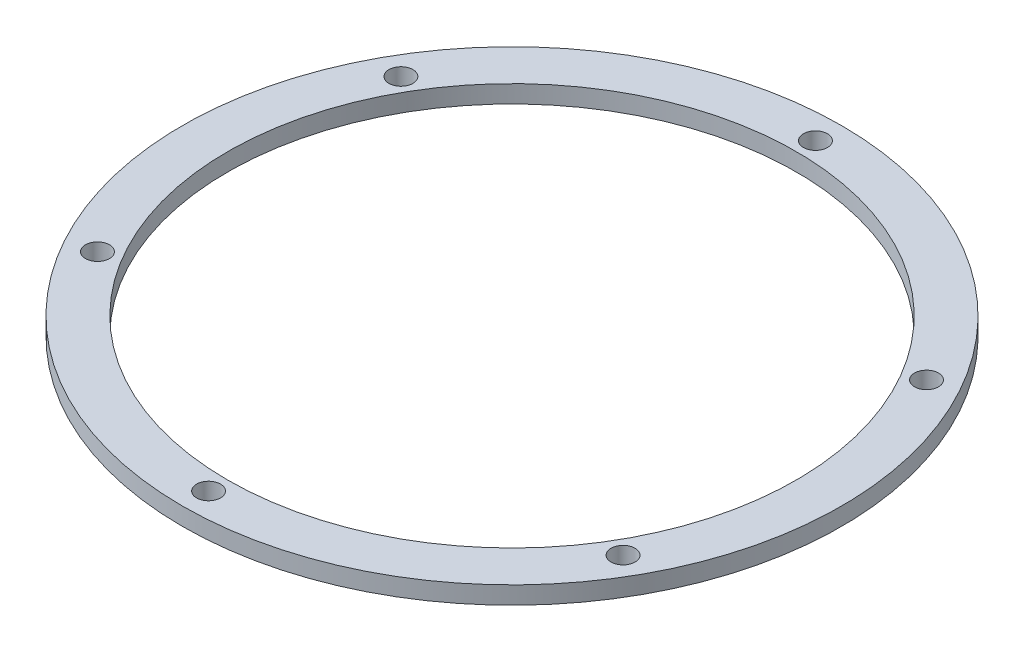
ISO-10303-21;
HEADER;
FILE_DESCRIPTION(('STEP AP214'),'2;1');
FILE_NAME('part.step','',(''),(''),'','','');
FILE_SCHEMA(('AUTOMOTIVE_DESIGN { 1 0 10303 214 1 1 1 1 }'));
ENDSEC;
DATA;
#1=APPLICATION_CONTEXT('core data for automotive mechanical design processes');
#2=APPLICATION_PROTOCOL_DEFINITION('international standard','automotive_design',2000,#1);
#3=PRODUCT_CONTEXT('',#1,'mechanical');
#4=PRODUCT('Part','Part','',(#3));
#5=PRODUCT_RELATED_PRODUCT_CATEGORY('part','',(#4));
#6=PRODUCT_DEFINITION_FORMATION('','',#4);
#7=PRODUCT_DEFINITION_CONTEXT('part definition',#1,'design');
#8=PRODUCT_DEFINITION('design','',#6,#7);
#9=PRODUCT_DEFINITION_SHAPE('','',#8);
#10=(LENGTH_UNIT() NAMED_UNIT(*) SI_UNIT(.MILLI.,.METRE.));
#11=(NAMED_UNIT(*) PLANE_ANGLE_UNIT() SI_UNIT($,.RADIAN.));
#12=(NAMED_UNIT(*) SI_UNIT($,.STERADIAN.) SOLID_ANGLE_UNIT());
#13=UNCERTAINTY_MEASURE_WITH_UNIT(LENGTH_MEASURE(1.E-05),#10,'distance_accuracy_value','');
#14=(GEOMETRIC_REPRESENTATION_CONTEXT(3) GLOBAL_UNCERTAINTY_ASSIGNED_CONTEXT((#13)) GLOBAL_UNIT_ASSIGNED_CONTEXT((#10,
#11,#12)) REPRESENTATION_CONTEXT('',''));
#15=CARTESIAN_POINT('',(0.,0.,0.));
#16=DIRECTION('',(0.,0.,1.));
#17=DIRECTION('',(1.,0.,0.));
#18=AXIS2_PLACEMENT_3D('',#15,#16,#17);
#19=CARTESIAN_POINT('',(0.,3.175,0.));
#20=DIRECTION('',(0.,1.,0.));
#21=DIRECTION('',(0.,0.,1.));
#22=AXIS2_PLACEMENT_3D('',#19,#20,#21);
#23=PLANE('',#22);
#24=CARTESIAN_POINT('',(47.2936473006679,3.175,-27.3050000000006));
#25=DIRECTION('',(0.,1.,0.));
#26=DIRECTION('',(-0.866025403784433,0.,0.50000000000001));
#27=AXIS2_PLACEMENT_3D('',#24,#25,#26);
#28=CIRCLE('',#27,2.159);
#29=CARTESIAN_POINT('',(45.4238984538973,3.175,-26.2255000000005));
#30=VERTEX_POINT('',#29);
#31=EDGE_CURVE('E67',#30,#30,#28,.T.);
#32=ORIENTED_EDGE('',*,*,#31,.F.);
#33=EDGE_LOOP('',(#32));
#34=FACE_BOUND('',#33,.T.);
#35=CARTESIAN_POINT('',(47.2936473006684,3.175,27.3049999999996));
#36=DIRECTION('',(0.,1.,0.));
#37=DIRECTION('',(-0.866025403784443,0.,-0.499999999999992));
#38=AXIS2_PLACEMENT_3D('',#35,#36,#37);
#39=CIRCLE('',#38,2.159);
#40=CARTESIAN_POINT('',(45.4238984538978,3.175,26.2254999999996));
#41=VERTEX_POINT('',#40);
#42=EDGE_CURVE('E66',#41,#41,#39,.T.);
#43=ORIENTED_EDGE('',*,*,#42,.F.);
#44=EDGE_LOOP('',(#43));
#45=FACE_BOUND('',#44,.T.);
#46=CARTESIAN_POINT('',(0.,3.175,54.61));
#47=DIRECTION('',(0.,1.,0.));
#48=DIRECTION('',(0.,0.,-1.));
#49=AXIS2_PLACEMENT_3D('',#46,#47,#48);
#50=CIRCLE('',#49,2.159);
#51=CARTESIAN_POINT('',(0.,3.175,52.451));
#52=VERTEX_POINT('',#51);
#53=EDGE_CURVE('E73',#52,#52,#50,.T.);
#54=ORIENTED_EDGE('',*,*,#53,.F.);
#55=EDGE_LOOP('',(#54));
#56=FACE_BOUND('',#55,.T.);
#57=CARTESIAN_POINT('',(-47.2936473006681,3.175,27.3050000000002));
#58=DIRECTION('',(0.,1.,0.));
#59=DIRECTION('',(0.866025403784436,0.,-0.500000000000004));
#60=AXIS2_PLACEMENT_3D('',#57,#58,#59);
#61=CIRCLE('',#60,2.159);
#62=CARTESIAN_POINT('',(-45.4238984538975,3.175,26.2255000000002));
#63=VERTEX_POINT('',#62);
#64=EDGE_CURVE('E79',#63,#63,#61,.T.);
#65=ORIENTED_EDGE('',*,*,#64,.F.);
#66=EDGE_LOOP('',(#65));
#67=FACE_BOUND('',#66,.T.);
#68=CARTESIAN_POINT('',(-47.2936473006683,3.175,-27.3049999999999));
#69=DIRECTION('',(0.,1.,0.));
#70=DIRECTION('',(0.86602540378444,0.,0.499999999999998));
#71=AXIS2_PLACEMENT_3D('',#68,#69,#70);
#72=CIRCLE('',#71,2.159);
#73=CARTESIAN_POINT('',(-45.4238984538976,3.175,-26.2254999999999));
#74=VERTEX_POINT('',#73);
#75=EDGE_CURVE('E59',#74,#74,#72,.T.);
#76=ORIENTED_EDGE('',*,*,#75,.F.);
#77=EDGE_LOOP('',(#76));
#78=FACE_BOUND('',#77,.T.);
#79=CARTESIAN_POINT('',(0.,3.175,-54.61));
#80=DIRECTION('',(0.,1.,0.));
#81=DIRECTION('',(0.,0.,1.));
#82=AXIS2_PLACEMENT_3D('',#79,#80,#81);
#83=CIRCLE('',#82,2.159);
#84=CARTESIAN_POINT('',(0.,3.175,-52.451));
#85=VERTEX_POINT('',#84);
#86=EDGE_CURVE('E53',#85,#85,#83,.T.);
#87=ORIENTED_EDGE('',*,*,#86,.F.);
#88=EDGE_LOOP('',(#87));
#89=FACE_BOUND('',#88,.T.);
#90=CARTESIAN_POINT('',(0.,3.175,0.));
#91=DIRECTION('',(0.,1.,0.));
#92=DIRECTION('',(0.,0.,1.));
#93=AXIS2_PLACEMENT_3D('',#90,#91,#92);
#94=CIRCLE('',#93,59.309);
#95=CARTESIAN_POINT('',(0.,3.175,59.309));
#96=VERTEX_POINT('',#95);
#97=EDGE_CURVE('E10',#96,#96,#94,.T.);
#98=ORIENTED_EDGE('',*,*,#97,.T.);
#99=EDGE_LOOP('',(#98));
#100=FACE_BOUND('',#99,.T.);
#101=CARTESIAN_POINT('',(0.,3.175,0.));
#102=DIRECTION('',(0.,1.,0.));
#103=DIRECTION('',(0.,0.,1.));
#104=AXIS2_PLACEMENT_3D('',#101,#102,#103);
#105=CIRCLE('',#104,51.181);
#106=CARTESIAN_POINT('',(0.,3.175,51.181));
#107=VERTEX_POINT('',#106);
#108=EDGE_CURVE('E43',#107,#107,#105,.T.);
#109=ORIENTED_EDGE('',*,*,#108,.F.);
#110=EDGE_LOOP('',(#109));
#111=FACE_BOUND('',#110,.T.);
#112=ADVANCED_FACE('F32',(#34,#45,#56,#67,#78,#89,#100,#111),#23,.T.);
#113=CARTESIAN_POINT('',(0.,0.,0.));
#114=DIRECTION('',(0.,1.,0.));
#115=DIRECTION('',(0.,0.,1.));
#116=AXIS2_PLACEMENT_3D('',#113,#114,#115);
#117=PLANE('',#116);
#118=CARTESIAN_POINT('',(47.2936473006679,0.,-27.3050000000006));
#119=DIRECTION('',(0.,1.,0.));
#120=DIRECTION('',(0.,0.,1.));
#121=AXIS2_PLACEMENT_3D('',#118,#119,#120);
#122=CIRCLE('',#121,2.159);
#123=CARTESIAN_POINT('',(47.2936473006679,0.,-25.1460000000006));
#124=VERTEX_POINT('',#123);
#125=EDGE_CURVE('E63',#124,#124,#122,.F.);
#126=ORIENTED_EDGE('',*,*,#125,.F.);
#127=EDGE_LOOP('',(#126));
#128=FACE_BOUND('',#127,.T.);
#129=CARTESIAN_POINT('',(47.2936473006684,0.,27.3049999999996));
#130=DIRECTION('',(0.,1.,0.));
#131=DIRECTION('',(0.,0.,1.));
#132=AXIS2_PLACEMENT_3D('',#129,#130,#131);
#133=CIRCLE('',#132,2.159);
#134=CARTESIAN_POINT('',(47.2936473006684,0.,29.4639999999996));
#135=VERTEX_POINT('',#134);
#136=EDGE_CURVE('E70',#135,#135,#133,.F.);
#137=ORIENTED_EDGE('',*,*,#136,.F.);
#138=EDGE_LOOP('',(#137));
#139=FACE_BOUND('',#138,.T.);
#140=CARTESIAN_POINT('',(0.,0.,54.61));
#141=DIRECTION('',(0.,1.,0.));
#142=DIRECTION('',(0.,0.,1.));
#143=AXIS2_PLACEMENT_3D('',#140,#141,#142);
#144=CIRCLE('',#143,2.159);
#145=CARTESIAN_POINT('',(0.,0.,56.769));
#146=VERTEX_POINT('',#145);
#147=EDGE_CURVE('E76',#146,#146,#144,.F.);
#148=ORIENTED_EDGE('',*,*,#147,.F.);
#149=EDGE_LOOP('',(#148));
#150=FACE_BOUND('',#149,.T.);
#151=CARTESIAN_POINT('',(-47.2936473006681,0.,27.3050000000002));
#152=DIRECTION('',(0.,1.,0.));
#153=DIRECTION('',(0.,0.,1.));
#154=AXIS2_PLACEMENT_3D('',#151,#152,#153);
#155=CIRCLE('',#154,2.159);
#156=CARTESIAN_POINT('',(-47.2936473006681,0.,29.4640000000002));
#157=VERTEX_POINT('',#156);
#158=EDGE_CURVE('E62',#157,#157,#155,.F.);
#159=ORIENTED_EDGE('',*,*,#158,.F.);
#160=EDGE_LOOP('',(#159));
#161=FACE_BOUND('',#160,.T.);
#162=CARTESIAN_POINT('',(-47.2936473006683,0.,-27.3049999999999));
#163=DIRECTION('',(0.,1.,0.));
#164=DIRECTION('',(0.,0.,1.));
#165=AXIS2_PLACEMENT_3D('',#162,#163,#164);
#166=CIRCLE('',#165,2.159);
#167=CARTESIAN_POINT('',(-47.2936473006683,0.,-25.1459999999999));
#168=VERTEX_POINT('',#167);
#169=EDGE_CURVE('E56',#168,#168,#166,.F.);
#170=ORIENTED_EDGE('',*,*,#169,.F.);
#171=EDGE_LOOP('',(#170));
#172=FACE_BOUND('',#171,.T.);
#173=CARTESIAN_POINT('',(0.,0.,-54.61));
#174=DIRECTION('',(0.,1.,0.));
#175=DIRECTION('',(0.,0.,1.));
#176=AXIS2_PLACEMENT_3D('',#173,#174,#175);
#177=CIRCLE('',#176,2.159);
#178=CARTESIAN_POINT('',(0.,0.,-52.451));
#179=VERTEX_POINT('',#178);
#180=EDGE_CURVE('E48',#179,#179,#177,.F.);
#181=ORIENTED_EDGE('',*,*,#180,.F.);
#182=EDGE_LOOP('',(#181));
#183=FACE_BOUND('',#182,.T.);
#184=CARTESIAN_POINT('',(0.,0.,0.));
#185=DIRECTION('',(0.,1.,0.));
#186=DIRECTION('',(0.,0.,1.));
#187=AXIS2_PLACEMENT_3D('',#184,#185,#186);
#188=CIRCLE('',#187,59.309);
#189=CARTESIAN_POINT('',(0.,0.,59.309));
#190=VERTEX_POINT('',#189);
#191=EDGE_CURVE('E36',#190,#190,#188,.T.);
#192=ORIENTED_EDGE('',*,*,#191,.F.);
#193=EDGE_LOOP('',(#192));
#194=FACE_BOUND('',#193,.T.);
#195=CARTESIAN_POINT('',(0.,0.,0.));
#196=DIRECTION('',(0.,1.,0.));
#197=DIRECTION('',(0.,0.,1.));
#198=AXIS2_PLACEMENT_3D('',#195,#196,#197);
#199=CIRCLE('',#198,51.181);
#200=CARTESIAN_POINT('',(0.,0.,51.181));
#201=VERTEX_POINT('',#200);
#202=EDGE_CURVE('E45',#201,#201,#199,.T.);
#203=ORIENTED_EDGE('',*,*,#202,.T.);
#204=EDGE_LOOP('',(#203));
#205=FACE_BOUND('',#204,.T.);
#206=ADVANCED_FACE('F92',(#128,#139,#150,#161,#172,#183,#194,#205),#117,.F.);
#207=CARTESIAN_POINT('',(0.,3.175,0.));
#208=DIRECTION('',(0.,-1.,0.));
#209=DIRECTION('',(0.,0.,-1.));
#210=AXIS2_PLACEMENT_3D('',#207,#208,#209);
#211=CYLINDRICAL_SURFACE('',#210,59.309);
#212=ORIENTED_EDGE('',*,*,#97,.F.);
#213=EDGE_LOOP('',(#212));
#214=FACE_BOUND('',#213,.T.);
#215=ORIENTED_EDGE('',*,*,#191,.T.);
#216=EDGE_LOOP('',(#215));
#217=FACE_BOUND('',#216,.T.);
#218=ADVANCED_FACE('F34',(#214,#217),#211,.T.);
#219=CARTESIAN_POINT('',(0.,3.175,0.));
#220=DIRECTION('',(0.,-1.,0.));
#221=DIRECTION('',(0.,0.,-1.));
#222=AXIS2_PLACEMENT_3D('',#219,#220,#221);
#223=CYLINDRICAL_SURFACE('',#222,51.181);
#224=ORIENTED_EDGE('',*,*,#108,.T.);
#225=EDGE_LOOP('',(#224));
#226=FACE_BOUND('',#225,.T.);
#227=ORIENTED_EDGE('',*,*,#202,.F.);
#228=EDGE_LOOP('',(#227));
#229=FACE_BOUND('',#228,.T.);
#230=ADVANCED_FACE('F101',(#226,#229),#223,.F.);
#231=CARTESIAN_POINT('',(0.,-0.00100000000000013,-54.61));
#232=DIRECTION('',(0.,1.,0.));
#233=DIRECTION('',(0.,0.,1.));
#234=AXIS2_PLACEMENT_3D('',#231,#232,#233);
#235=CYLINDRICAL_SURFACE('',#234,2.159);
#236=ORIENTED_EDGE('',*,*,#86,.T.);
#237=EDGE_LOOP('',(#236));
#238=FACE_BOUND('',#237,.T.);
#239=ORIENTED_EDGE('',*,*,#180,.T.);
#240=EDGE_LOOP('',(#239));
#241=FACE_BOUND('',#240,.T.);
#242=ADVANCED_FACE('F104',(#238,#241),#235,.F.);
#243=CARTESIAN_POINT('',(-47.2936473006683,-0.00100000000000013,-27.3049999999999));
#244=DIRECTION('',(0.,1.,0.));
#245=DIRECTION('',(0.,0.,1.));
#246=AXIS2_PLACEMENT_3D('',#243,#244,#245);
#247=CYLINDRICAL_SURFACE('',#246,2.159);
#248=ORIENTED_EDGE('',*,*,#75,.T.);
#249=EDGE_LOOP('',(#248));
#250=FACE_BOUND('',#249,.T.);
#251=ORIENTED_EDGE('',*,*,#169,.T.);
#252=EDGE_LOOP('',(#251));
#253=FACE_BOUND('',#252,.T.);
#254=ADVANCED_FACE('F119',(#250,#253),#247,.F.);
#255=CARTESIAN_POINT('',(-47.2936473006681,-0.00100000000000013,27.3050000000002));
#256=DIRECTION('',(0.,1.,0.));
#257=DIRECTION('',(0.,0.,1.));
#258=AXIS2_PLACEMENT_3D('',#255,#256,#257);
#259=CYLINDRICAL_SURFACE('',#258,2.159);
#260=ORIENTED_EDGE('',*,*,#64,.T.);
#261=EDGE_LOOP('',(#260));
#262=FACE_BOUND('',#261,.T.);
#263=ORIENTED_EDGE('',*,*,#158,.T.);
#264=EDGE_LOOP('',(#263));
#265=FACE_BOUND('',#264,.T.);
#266=ADVANCED_FACE('F87',(#262,#265),#259,.F.);
#267=CARTESIAN_POINT('',(0.,-0.00100000000000013,54.61));
#268=DIRECTION('',(0.,1.,0.));
#269=DIRECTION('',(0.,0.,1.));
#270=AXIS2_PLACEMENT_3D('',#267,#268,#269);
#271=CYLINDRICAL_SURFACE('',#270,2.159);
#272=ORIENTED_EDGE('',*,*,#53,.T.);
#273=EDGE_LOOP('',(#272));
#274=FACE_BOUND('',#273,.T.);
#275=ORIENTED_EDGE('',*,*,#147,.T.);
#276=EDGE_LOOP('',(#275));
#277=FACE_BOUND('',#276,.T.);
#278=ADVANCED_FACE('F131',(#274,#277),#271,.F.);
#279=CARTESIAN_POINT('',(47.2936473006684,-0.00100000000000013,27.3049999999996));
#280=DIRECTION('',(0.,1.,0.));
#281=DIRECTION('',(0.,0.,1.));
#282=AXIS2_PLACEMENT_3D('',#279,#280,#281);
#283=CYLINDRICAL_SURFACE('',#282,2.159);
#284=ORIENTED_EDGE('',*,*,#42,.T.);
#285=EDGE_LOOP('',(#284));
#286=FACE_BOUND('',#285,.T.);
#287=ORIENTED_EDGE('',*,*,#136,.T.);
#288=EDGE_LOOP('',(#287));
#289=FACE_BOUND('',#288,.T.);
#290=ADVANCED_FACE('F127',(#286,#289),#283,.F.);
#291=CARTESIAN_POINT('',(47.2936473006679,-0.00100000000000013,-27.3050000000006));
#292=DIRECTION('',(0.,1.,0.));
#293=DIRECTION('',(0.,0.,1.));
#294=AXIS2_PLACEMENT_3D('',#291,#292,#293);
#295=CYLINDRICAL_SURFACE('',#294,2.159);
#296=ORIENTED_EDGE('',*,*,#31,.T.);
#297=EDGE_LOOP('',(#296));
#298=FACE_BOUND('',#297,.T.);
#299=ORIENTED_EDGE('',*,*,#125,.T.);
#300=EDGE_LOOP('',(#299));
#301=FACE_BOUND('',#300,.T.);
#302=ADVANCED_FACE('F124',(#298,#301),#295,.F.);
#303=CLOSED_SHELL('',(#112,#206,#218,#230,#242,#254,#266,#278,#290,#302));
#304=MANIFOLD_SOLID_BREP('B2',#303);
#305=ADVANCED_BREP_SHAPE_REPRESENTATION('',(#18,#304),#14);
#306=SHAPE_DEFINITION_REPRESENTATION(#9,#305);
ENDSEC;
END-ISO-10303-21;
